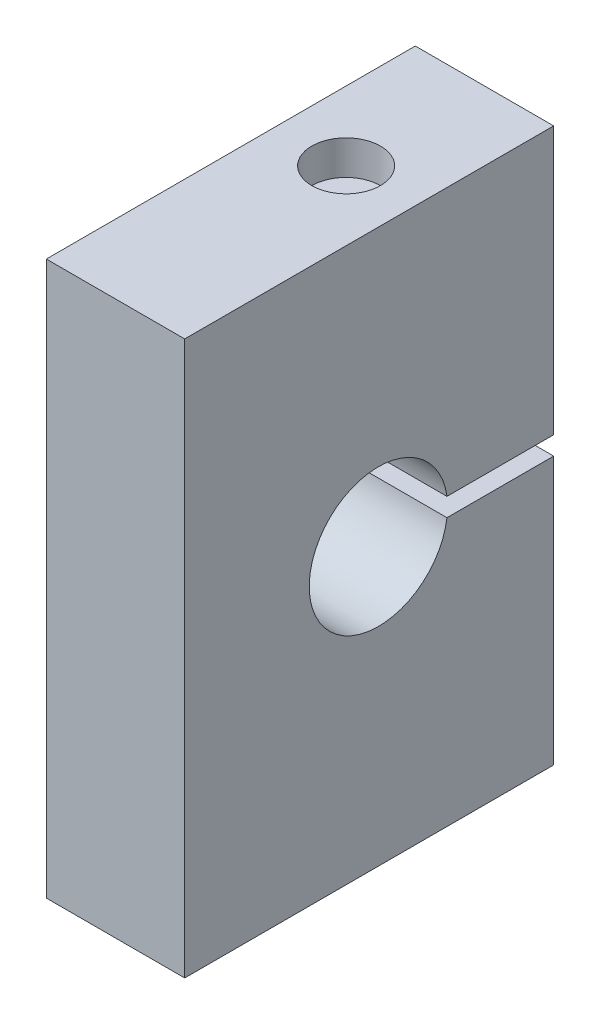
ISO-10303-21;
HEADER;
FILE_DESCRIPTION(('STEP AP214'),'2;1');
FILE_NAME('part.step','',(''),(''),'','','');
FILE_SCHEMA(('AUTOMOTIVE_DESIGN { 1 0 10303 214 1 1 1 1 }'));
ENDSEC;
DATA;
#1=APPLICATION_CONTEXT('core data for automotive mechanical design processes');
#2=APPLICATION_PROTOCOL_DEFINITION('international standard','automotive_design',2000,#1);
#3=PRODUCT_CONTEXT('',#1,'mechanical');
#4=PRODUCT('Part','Part','',(#3));
#5=PRODUCT_RELATED_PRODUCT_CATEGORY('part','',(#4));
#6=PRODUCT_DEFINITION_FORMATION('','',#4);
#7=PRODUCT_DEFINITION_CONTEXT('part definition',#1,'design');
#8=PRODUCT_DEFINITION('design','',#6,#7);
#9=PRODUCT_DEFINITION_SHAPE('','',#8);
#10=(LENGTH_UNIT() NAMED_UNIT(*) SI_UNIT(.MILLI.,.METRE.));
#11=(NAMED_UNIT(*) PLANE_ANGLE_UNIT() SI_UNIT($,.RADIAN.));
#12=(NAMED_UNIT(*) SI_UNIT($,.STERADIAN.) SOLID_ANGLE_UNIT());
#13=UNCERTAINTY_MEASURE_WITH_UNIT(LENGTH_MEASURE(1.E-05),#10,'distance_accuracy_value','');
#14=(GEOMETRIC_REPRESENTATION_CONTEXT(3) GLOBAL_UNCERTAINTY_ASSIGNED_CONTEXT((#13)) GLOBAL_UNIT_ASSIGNED_CONTEXT((#10,
#11,#12)) REPRESENTATION_CONTEXT('',''));
#15=CARTESIAN_POINT('',(0.,0.,0.));
#16=DIRECTION('',(0.,0.,1.));
#17=DIRECTION('',(1.,0.,0.));
#18=AXIS2_PLACEMENT_3D('',#15,#16,#17);
#19=CARTESIAN_POINT('',(19.05,0.,0.));
#20=DIRECTION('',(0.,0.,-1.));
#21=DIRECTION('',(-1.,0.,0.));
#22=AXIS2_PLACEMENT_3D('',#19,#20,#21);
#23=PLANE('',#22);
#24=DIRECTION('',(0.,-1.,0.));
#25=VECTOR('',#24,1.);
#26=CARTESIAN_POINT('',(0.,0.,0.));
#27=LINE('',#26,#25);
#28=CARTESIAN_POINT('',(0.,76.2,0.));
#29=VERTEX_POINT('',#28);
#30=CARTESIAN_POINT('',(0.,0.,0.));
#31=VERTEX_POINT('',#30);
#32=EDGE_CURVE('E138',#29,#31,#27,.T.);
#33=ORIENTED_EDGE('',*,*,#32,.T.);
#34=DIRECTION('',(-1.,0.,0.));
#35=VECTOR('',#34,1.);
#36=CARTESIAN_POINT('',(19.05,0.,0.));
#37=LINE('',#36,#35);
#38=CARTESIAN_POINT('',(19.05,0.,0.));
#39=VERTEX_POINT('',#38);
#40=EDGE_CURVE('E11',#39,#31,#37,.T.);
#41=ORIENTED_EDGE('',*,*,#40,.F.);
#42=DIRECTION('',(0.,-1.,0.));
#43=VECTOR('',#42,1.);
#44=CARTESIAN_POINT('',(19.05,0.,0.));
#45=LINE('',#44,#43);
#46=CARTESIAN_POINT('',(19.05,76.2,0.));
#47=VERTEX_POINT('',#46);
#48=EDGE_CURVE('E153',#47,#39,#45,.T.);
#49=ORIENTED_EDGE('',*,*,#48,.F.);
#50=DIRECTION('',(-1.,0.,0.));
#51=VECTOR('',#50,1.);
#52=CARTESIAN_POINT('',(19.05,76.2,0.));
#53=LINE('',#52,#51);
#54=EDGE_CURVE('E134',#47,#29,#53,.T.);
#55=ORIENTED_EDGE('',*,*,#54,.T.);
#56=EDGE_LOOP('',(#33,#41,#49,#55));
#57=FACE_BOUND('',#56,.T.);
#58=ADVANCED_FACE('F39',(#57),#23,.F.);
#59=CARTESIAN_POINT('',(19.05,0.,0.));
#60=DIRECTION('',(0.,1.,0.));
#61=DIRECTION('',(0.,0.,1.));
#62=AXIS2_PLACEMENT_3D('',#59,#60,#61);
#63=PLANE('',#62);
#64=CARTESIAN_POINT('',(9.525,0.,-12.7));
#65=DIRECTION('',(0.,-1.,0.));
#66=DIRECTION('',(0.,0.,-1.));
#67=AXIS2_PLACEMENT_3D('',#64,#65,#66);
#68=CIRCLE('',#67,3.1877);
#69=CARTESIAN_POINT('',(9.525,0.,-15.8877));
#70=VERTEX_POINT('',#69);
#71=EDGE_CURVE('E200',#70,#70,#68,.T.);
#72=ORIENTED_EDGE('',*,*,#71,.F.);
#73=EDGE_LOOP('',(#72));
#74=FACE_BOUND('',#73,.T.);
#75=CARTESIAN_POINT('',(9.525,0.,-38.1));
#76=DIRECTION('',(0.,-1.,0.));
#77=DIRECTION('',(0.,0.,-1.));
#78=AXIS2_PLACEMENT_3D('',#75,#76,#77);
#79=CIRCLE('',#78,3.1877);
#80=CARTESIAN_POINT('',(9.525,0.,-41.2877));
#81=VERTEX_POINT('',#80);
#82=EDGE_CURVE('E191',#81,#81,#79,.T.);
#83=ORIENTED_EDGE('',*,*,#82,.F.);
#84=EDGE_LOOP('',(#83));
#85=FACE_BOUND('',#84,.T.);
#86=DIRECTION('',(0.,0.,-1.));
#87=VECTOR('',#86,1.);
#88=CARTESIAN_POINT('',(0.,0.,0.));
#89=LINE('',#88,#87);
#90=CARTESIAN_POINT('',(0.,0.,-50.8));
#91=VERTEX_POINT('',#90);
#92=EDGE_CURVE('E141',#31,#91,#89,.T.);
#93=ORIENTED_EDGE('',*,*,#92,.T.);
#94=DIRECTION('',(-1.,0.,0.));
#95=VECTOR('',#94,1.);
#96=CARTESIAN_POINT('',(19.05,0.,-50.8));
#97=LINE('',#96,#95);
#98=CARTESIAN_POINT('',(19.05,0.,-50.8));
#99=VERTEX_POINT('',#98);
#100=EDGE_CURVE('E47',#99,#91,#97,.T.);
#101=ORIENTED_EDGE('',*,*,#100,.F.);
#102=DIRECTION('',(0.,0.,-1.));
#103=VECTOR('',#102,1.);
#104=CARTESIAN_POINT('',(19.05,0.,0.));
#105=LINE('',#104,#103);
#106=EDGE_CURVE('E99',#39,#99,#105,.T.);
#107=ORIENTED_EDGE('',*,*,#106,.F.);
#108=ORIENTED_EDGE('',*,*,#40,.T.);
#109=EDGE_LOOP('',(#93,#101,#107,#108));
#110=FACE_BOUND('',#109,.T.);
#111=ADVANCED_FACE('F230',(#74,#85,#110),#63,.F.);
#112=CARTESIAN_POINT('',(19.05,0.,-50.8));
#113=DIRECTION('',(0.,0.,1.));
#114=DIRECTION('',(1.,0.,0.));
#115=AXIS2_PLACEMENT_3D('',#112,#113,#114);
#116=PLANE('',#115);
#117=DIRECTION('',(0.,1.,0.));
#118=VECTOR('',#117,1.);
#119=CARTESIAN_POINT('',(0.,0.,-50.8));
#120=LINE('',#119,#118);
#121=CARTESIAN_POINT('',(0.,36.83,-50.8));
#122=VERTEX_POINT('',#121);
#123=EDGE_CURVE('E144',#91,#122,#120,.T.);
#124=ORIENTED_EDGE('',*,*,#123,.T.);
#125=DIRECTION('',(-1.,0.,0.));
#126=VECTOR('',#125,1.);
#127=CARTESIAN_POINT('',(19.05,36.83,-50.8));
#128=LINE('',#127,#126);
#129=CARTESIAN_POINT('',(19.05,36.83,-50.8));
#130=VERTEX_POINT('',#129);
#131=EDGE_CURVE('E160',#130,#122,#128,.T.);
#132=ORIENTED_EDGE('',*,*,#131,.F.);
#133=DIRECTION('',(0.,1.,0.));
#134=VECTOR('',#133,1.);
#135=CARTESIAN_POINT('',(19.05,0.,-50.8));
#136=LINE('',#135,#134);
#137=EDGE_CURVE('E168',#99,#130,#136,.T.);
#138=ORIENTED_EDGE('',*,*,#137,.F.);
#139=ORIENTED_EDGE('',*,*,#100,.T.);
#140=EDGE_LOOP('',(#124,#132,#138,#139));
#141=FACE_BOUND('',#140,.T.);
#142=ADVANCED_FACE('F166',(#141),#116,.F.);
#143=CARTESIAN_POINT('',(19.05,36.83,-36.1099536545472));
#144=DIRECTION('',(0.,-1.,0.));
#145=DIRECTION('',(0.,0.,-1.));
#146=AXIS2_PLACEMENT_3D('',#143,#144,#145);
#147=PLANE('',#146);
#148=DIRECTION('',(0.,0.,1.));
#149=VECTOR('',#148,1.);
#150=CARTESIAN_POINT('',(0.,36.83,-36.1099536545472));
#151=LINE('',#150,#149);
#152=CARTESIAN_POINT('',(0.,36.83,-36.1099536545472));
#153=VERTEX_POINT('',#152);
#154=EDGE_CURVE('E146',#122,#153,#151,.T.);
#155=ORIENTED_EDGE('',*,*,#154,.T.);
#156=DIRECTION('',(-1.,0.,0.));
#157=VECTOR('',#156,1.);
#158=CARTESIAN_POINT('',(19.05,36.83,-36.1099536545472));
#159=LINE('',#158,#157);
#160=CARTESIAN_POINT('',(19.05,36.83,-36.1099536545472));
#161=VERTEX_POINT('',#160);
#162=EDGE_CURVE('E157',#161,#153,#159,.T.);
#163=ORIENTED_EDGE('',*,*,#162,.F.);
#164=DIRECTION('',(0.,0.,1.));
#165=VECTOR('',#164,1.);
#166=CARTESIAN_POINT('',(19.05,36.83,-36.1099536545472));
#167=LINE('',#166,#165);
#168=EDGE_CURVE('E180',#130,#161,#167,.T.);
#169=ORIENTED_EDGE('',*,*,#168,.F.);
#170=ORIENTED_EDGE('',*,*,#131,.T.);
#171=EDGE_LOOP('',(#155,#163,#169,#170));
#172=FACE_BOUND('',#171,.T.);
#173=ADVANCED_FACE('F176',(#172),#147,.F.);
#174=CARTESIAN_POINT('',(19.05,38.1,-26.67));
#175=DIRECTION('',(-1.,0.,0.));
#176=DIRECTION('',(0.,0.,1.));
#177=AXIS2_PLACEMENT_3D('',#174,#175,#176);
#178=CYLINDRICAL_SURFACE('',#177,9.525);
#179=CARTESIAN_POINT('',(0.,38.1,-26.67));
#180=DIRECTION('',(-1.,0.,0.));
#181=DIRECTION('',(0.,0.,-1.));
#182=AXIS2_PLACEMENT_3D('',#179,#180,#181);
#183=CIRCLE('',#182,9.525);
#184=CARTESIAN_POINT('',(0.,39.37,-36.1099536545472));
#185=VERTEX_POINT('',#184);
#186=EDGE_CURVE('E148',#153,#185,#183,.T.);
#187=ORIENTED_EDGE('',*,*,#186,.T.);
#188=DIRECTION('',(-1.,0.,0.));
#189=VECTOR('',#188,1.);
#190=CARTESIAN_POINT('',(19.05,39.37,-36.1099536545472));
#191=LINE('',#190,#189);
#192=CARTESIAN_POINT('',(19.05,39.37,-36.1099536545472));
#193=VERTEX_POINT('',#192);
#194=EDGE_CURVE('E129',#193,#185,#191,.T.);
#195=ORIENTED_EDGE('',*,*,#194,.F.);
#196=CARTESIAN_POINT('',(19.05,38.1,-26.67));
#197=DIRECTION('',(-1.,0.,0.));
#198=DIRECTION('',(0.,0.,-1.));
#199=AXIS2_PLACEMENT_3D('',#196,#197,#198);
#200=CIRCLE('',#199,9.525);
#201=EDGE_CURVE('E120',#161,#193,#200,.T.);
#202=ORIENTED_EDGE('',*,*,#201,.F.);
#203=ORIENTED_EDGE('',*,*,#162,.T.);
#204=EDGE_LOOP('',(#187,#195,#202,#203));
#205=FACE_BOUND('',#204,.T.);
#206=ADVANCED_FACE('F179',(#205),#178,.F.);
#207=CARTESIAN_POINT('',(19.05,39.37,-36.1099536545472));
#208=DIRECTION('',(0.,1.,0.));
#209=DIRECTION('',(0.,0.,1.));
#210=AXIS2_PLACEMENT_3D('',#207,#208,#209);
#211=PLANE('',#210);
#212=DIRECTION('',(0.,0.,-1.));
#213=VECTOR('',#212,1.);
#214=CARTESIAN_POINT('',(0.,39.37,-36.1099536545472));
#215=LINE('',#214,#213);
#216=CARTESIAN_POINT('',(0.,39.37,-50.8));
#217=VERTEX_POINT('',#216);
#218=EDGE_CURVE('E128',#185,#217,#215,.T.);
#219=ORIENTED_EDGE('',*,*,#218,.T.);
#220=DIRECTION('',(-1.,0.,0.));
#221=VECTOR('',#220,1.);
#222=CARTESIAN_POINT('',(19.05,39.37,-50.8));
#223=LINE('',#222,#221);
#224=CARTESIAN_POINT('',(19.05,39.37,-50.8));
#225=VERTEX_POINT('',#224);
#226=EDGE_CURVE('E125',#225,#217,#223,.T.);
#227=ORIENTED_EDGE('',*,*,#226,.F.);
#228=DIRECTION('',(0.,0.,-1.));
#229=VECTOR('',#228,1.);
#230=CARTESIAN_POINT('',(19.05,39.37,-36.1099536545472));
#231=LINE('',#230,#229);
#232=EDGE_CURVE('E114',#193,#225,#231,.T.);
#233=ORIENTED_EDGE('',*,*,#232,.F.);
#234=ORIENTED_EDGE('',*,*,#194,.T.);
#235=EDGE_LOOP('',(#219,#227,#233,#234));
#236=FACE_BOUND('',#235,.T.);
#237=ADVANCED_FACE('F126',(#236),#211,.F.);
#238=CARTESIAN_POINT('',(19.05,39.37,-50.8));
#239=DIRECTION('',(0.,0.,1.));
#240=DIRECTION('',(1.,0.,0.));
#241=AXIS2_PLACEMENT_3D('',#238,#239,#240);
#242=PLANE('',#241);
#243=DIRECTION('',(0.,1.,0.));
#244=VECTOR('',#243,1.);
#245=CARTESIAN_POINT('',(0.,39.37,-50.8));
#246=LINE('',#245,#244);
#247=CARTESIAN_POINT('',(0.,76.2,-50.8));
#248=VERTEX_POINT('',#247);
#249=EDGE_CURVE('E85',#217,#248,#246,.T.);
#250=ORIENTED_EDGE('',*,*,#249,.T.);
#251=DIRECTION('',(-1.,0.,0.));
#252=VECTOR('',#251,1.);
#253=CARTESIAN_POINT('',(19.05,76.2,-50.8));
#254=LINE('',#253,#252);
#255=CARTESIAN_POINT('',(19.05,76.2,-50.8));
#256=VERTEX_POINT('',#255);
#257=EDGE_CURVE('E130',#256,#248,#254,.T.);
#258=ORIENTED_EDGE('',*,*,#257,.F.);
#259=DIRECTION('',(0.,1.,0.));
#260=VECTOR('',#259,1.);
#261=CARTESIAN_POINT('',(19.05,39.37,-50.8));
#262=LINE('',#261,#260);
#263=EDGE_CURVE('E118',#225,#256,#262,.T.);
#264=ORIENTED_EDGE('',*,*,#263,.F.);
#265=ORIENTED_EDGE('',*,*,#226,.T.);
#266=EDGE_LOOP('',(#250,#258,#264,#265));
#267=FACE_BOUND('',#266,.T.);
#268=ADVANCED_FACE('F132',(#267),#242,.F.);
#269=CARTESIAN_POINT('',(19.05,76.2,0.));
#270=DIRECTION('',(0.,-1.,0.));
#271=DIRECTION('',(0.,0.,-1.));
#272=AXIS2_PLACEMENT_3D('',#269,#270,#271);
#273=PLANE('',#272);
#274=CARTESIAN_POINT('',(9.525,76.2,-31.75));
#275=DIRECTION('',(0.,1.,0.));
#276=DIRECTION('',(0.,0.,1.));
#277=AXIS2_PLACEMENT_3D('',#274,#275,#276);
#278=CIRCLE('',#277,4.7244);
#279=CARTESIAN_POINT('',(9.525,76.2,-27.0256));
#280=VERTEX_POINT('',#279);
#281=EDGE_CURVE('E204',#280,#280,#278,.T.);
#282=ORIENTED_EDGE('',*,*,#281,.F.);
#283=EDGE_LOOP('',(#282));
#284=FACE_BOUND('',#283,.T.);
#285=DIRECTION('',(0.,0.,1.));
#286=VECTOR('',#285,1.);
#287=CARTESIAN_POINT('',(0.,76.2,0.));
#288=LINE('',#287,#286);
#289=EDGE_CURVE('E91',#248,#29,#288,.T.);
#290=ORIENTED_EDGE('',*,*,#289,.T.);
#291=ORIENTED_EDGE('',*,*,#54,.F.);
#292=DIRECTION('',(0.,0.,1.));
#293=VECTOR('',#292,1.);
#294=CARTESIAN_POINT('',(19.05,76.2,0.));
#295=LINE('',#294,#293);
#296=EDGE_CURVE('E55',#256,#47,#295,.T.);
#297=ORIENTED_EDGE('',*,*,#296,.F.);
#298=ORIENTED_EDGE('',*,*,#257,.T.);
#299=EDGE_LOOP('',(#290,#291,#297,#298));
#300=FACE_BOUND('',#299,.T.);
#301=ADVANCED_FACE('F219',(#284,#300),#273,.F.);
#302=CARTESIAN_POINT('',(19.05,38.1,-26.67));
#303=DIRECTION('',(1.,0.,0.));
#304=DIRECTION('',(0.,0.,-1.));
#305=AXIS2_PLACEMENT_3D('',#302,#303,#304);
#306=PLANE('',#305);
#307=ORIENTED_EDGE('',*,*,#48,.T.);
#308=ORIENTED_EDGE('',*,*,#106,.T.);
#309=ORIENTED_EDGE('',*,*,#137,.T.);
#310=ORIENTED_EDGE('',*,*,#168,.T.);
#311=ORIENTED_EDGE('',*,*,#201,.T.);
#312=ORIENTED_EDGE('',*,*,#232,.T.);
#313=ORIENTED_EDGE('',*,*,#263,.T.);
#314=ORIENTED_EDGE('',*,*,#296,.T.);
#315=EDGE_LOOP('',(#307,#308,#309,#310,#311,#312,#313,#314));
#316=FACE_BOUND('',#315,.T.);
#317=ADVANCED_FACE('F116',(#316),#306,.T.);
#318=CARTESIAN_POINT('',(0.,38.1,-26.67));
#319=DIRECTION('',(1.,0.,0.));
#320=DIRECTION('',(0.,0.,-1.));
#321=AXIS2_PLACEMENT_3D('',#318,#319,#320);
#322=PLANE('',#321);
#323=ORIENTED_EDGE('',*,*,#32,.F.);
#324=ORIENTED_EDGE('',*,*,#289,.F.);
#325=ORIENTED_EDGE('',*,*,#249,.F.);
#326=ORIENTED_EDGE('',*,*,#218,.F.);
#327=ORIENTED_EDGE('',*,*,#186,.F.);
#328=ORIENTED_EDGE('',*,*,#154,.F.);
#329=ORIENTED_EDGE('',*,*,#123,.F.);
#330=ORIENTED_EDGE('',*,*,#92,.F.);
#331=EDGE_LOOP('',(#323,#324,#325,#326,#327,#328,#329,#330));
#332=FACE_BOUND('',#331,.T.);
#333=ADVANCED_FACE('F172',(#332),#322,.F.);
#334=CARTESIAN_POINT('',(9.525,16.51,-38.1));
#335=DIRECTION('',(0.,-1.,0.));
#336=DIRECTION('',(0.,0.,-1.));
#337=AXIS2_PLACEMENT_3D('',#334,#335,#336);
#338=CONICAL_SURFACE('',#337,2.55269999999999,1.02974425867665);
#339=CARTESIAN_POINT('',(9.525,18.0438169021916,-38.1));
#340=VERTEX_POINT('',#339);
#341=VERTEX_LOOP('',#340);
#342=FACE_BOUND('',#341,.T.);
#343=CARTESIAN_POINT('',(9.525,16.51,-38.1));
#344=DIRECTION('',(0.,-1.,0.));
#345=DIRECTION('',(0.,0.,-1.));
#346=AXIS2_PLACEMENT_3D('',#343,#344,#345);
#347=CIRCLE('',#346,2.55269999999999);
#348=CARTESIAN_POINT('',(9.525,16.51,-40.6527));
#349=VERTEX_POINT('',#348);
#350=EDGE_CURVE('E142',#349,#349,#347,.T.);
#351=ORIENTED_EDGE('',*,*,#350,.T.);
#352=EDGE_LOOP('',(#351));
#353=FACE_BOUND('',#352,.T.);
#354=ADVANCED_FACE('F273',(#342,#353),#338,.F.);
#355=CARTESIAN_POINT('',(9.525,0.,-38.1));
#356=DIRECTION('',(0.,-1.,0.));
#357=DIRECTION('',(0.,0.,-1.));
#358=AXIS2_PLACEMENT_3D('',#355,#356,#357);
#359=CYLINDRICAL_SURFACE('',#358,2.55269999999999);
#360=ORIENTED_EDGE('',*,*,#350,.F.);
#361=EDGE_LOOP('',(#360));
#362=FACE_BOUND('',#361,.T.);
#363=CARTESIAN_POINT('',(9.525,0.635000000000004,-38.1));
#364=DIRECTION('',(0.,-1.,0.));
#365=DIRECTION('',(0.,0.,-1.));
#366=AXIS2_PLACEMENT_3D('',#363,#364,#365);
#367=CIRCLE('',#366,2.5527);
#368=CARTESIAN_POINT('',(9.525,0.635000000000004,-40.6527));
#369=VERTEX_POINT('',#368);
#370=EDGE_CURVE('E188',#369,#369,#367,.T.);
#371=ORIENTED_EDGE('',*,*,#370,.T.);
#372=EDGE_LOOP('',(#371));
#373=FACE_BOUND('',#372,.T.);
#374=ADVANCED_FACE('F288',(#362,#373),#359,.F.);
#375=CARTESIAN_POINT('',(9.525,0.,-38.1));
#376=DIRECTION('',(0.,-1.,0.));
#377=DIRECTION('',(0.,0.,-1.));
#378=AXIS2_PLACEMENT_3D('',#375,#376,#377);
#379=CONICAL_SURFACE('',#378,3.1877,0.785398163397446);
#380=ORIENTED_EDGE('',*,*,#370,.F.);
#381=EDGE_LOOP('',(#380));
#382=FACE_BOUND('',#381,.T.);
#383=ORIENTED_EDGE('',*,*,#82,.T.);
#384=EDGE_LOOP('',(#383));
#385=FACE_BOUND('',#384,.T.);
#386=ADVANCED_FACE('F299',(#382,#385),#379,.F.);
#387=CARTESIAN_POINT('',(9.525,16.51,-12.7));
#388=DIRECTION('',(0.,-1.,0.));
#389=DIRECTION('',(0.,0.,-1.));
#390=AXIS2_PLACEMENT_3D('',#387,#388,#389);
#391=CONICAL_SURFACE('',#390,2.55269999999999,1.02974425867665);
#392=CARTESIAN_POINT('',(9.525,18.0438169021916,-12.7));
#393=VERTEX_POINT('',#392);
#394=VERTEX_LOOP('',#393);
#395=FACE_BOUND('',#394,.T.);
#396=CARTESIAN_POINT('',(9.525,16.51,-12.7));
#397=DIRECTION('',(0.,-1.,0.));
#398=DIRECTION('',(0.,0.,-1.));
#399=AXIS2_PLACEMENT_3D('',#396,#397,#398);
#400=CIRCLE('',#399,2.55269999999999);
#401=CARTESIAN_POINT('',(9.525,16.51,-15.2527));
#402=VERTEX_POINT('',#401);
#403=EDGE_CURVE('E194',#402,#402,#400,.T.);
#404=ORIENTED_EDGE('',*,*,#403,.T.);
#405=EDGE_LOOP('',(#404));
#406=FACE_BOUND('',#405,.T.);
#407=ADVANCED_FACE('F311',(#395,#406),#391,.F.);
#408=CARTESIAN_POINT('',(9.525,0.,-12.7));
#409=DIRECTION('',(0.,-1.,0.));
#410=DIRECTION('',(0.,0.,-1.));
#411=AXIS2_PLACEMENT_3D('',#408,#409,#410);
#412=CYLINDRICAL_SURFACE('',#411,2.55269999999999);
#413=ORIENTED_EDGE('',*,*,#403,.F.);
#414=EDGE_LOOP('',(#413));
#415=FACE_BOUND('',#414,.T.);
#416=CARTESIAN_POINT('',(9.525,0.635000000000004,-12.7));
#417=DIRECTION('',(0.,-1.,0.));
#418=DIRECTION('',(0.,0.,-1.));
#419=AXIS2_PLACEMENT_3D('',#416,#417,#418);
#420=CIRCLE('',#419,2.5527);
#421=CARTESIAN_POINT('',(9.525,0.635000000000004,-15.2527));
#422=VERTEX_POINT('',#421);
#423=EDGE_CURVE('E197',#422,#422,#420,.T.);
#424=ORIENTED_EDGE('',*,*,#423,.T.);
#425=EDGE_LOOP('',(#424));
#426=FACE_BOUND('',#425,.T.);
#427=ADVANCED_FACE('F321',(#415,#426),#412,.F.);
#428=CARTESIAN_POINT('',(9.525,0.,-12.7));
#429=DIRECTION('',(0.,-1.,0.));
#430=DIRECTION('',(0.,0.,-1.));
#431=AXIS2_PLACEMENT_3D('',#428,#429,#430);
#432=CONICAL_SURFACE('',#431,3.1877,0.785398163397446);
#433=ORIENTED_EDGE('',*,*,#423,.F.);
#434=EDGE_LOOP('',(#433));
#435=FACE_BOUND('',#434,.T.);
#436=ORIENTED_EDGE('',*,*,#71,.T.);
#437=EDGE_LOOP('',(#436));
#438=FACE_BOUND('',#437,.T.);
#439=ADVANCED_FACE('F215',(#435,#438),#432,.F.);
#440=CARTESIAN_POINT('',(9.525,71.4756,-31.75));
#441=DIRECTION('',(0.,1.,0.));
#442=DIRECTION('',(0.,0.,1.));
#443=AXIS2_PLACEMENT_3D('',#440,#441,#442);
#444=CYLINDRICAL_SURFACE('',#443,4.7244);
#445=CARTESIAN_POINT('',(9.525,71.4756,-31.75));
#446=DIRECTION('',(0.,1.,0.));
#447=DIRECTION('',(0.,0.,1.));
#448=AXIS2_PLACEMENT_3D('',#445,#446,#447);
#449=CIRCLE('',#448,4.7244);
#450=CARTESIAN_POINT('',(9.525,71.4756,-27.0256));
#451=VERTEX_POINT('',#450);
#452=EDGE_CURVE('E203',#451,#451,#449,.T.);
#453=ORIENTED_EDGE('',*,*,#452,.F.);
#454=EDGE_LOOP('',(#453));
#455=FACE_BOUND('',#454,.T.);
#456=ORIENTED_EDGE('',*,*,#281,.T.);
#457=EDGE_LOOP('',(#456));
#458=FACE_BOUND('',#457,.T.);
#459=ADVANCED_FACE('F212',(#455,#458),#444,.F.);
#460=CARTESIAN_POINT('',(9.525,71.4756,-31.75));
#461=DIRECTION('',(0.,1.,0.));
#462=DIRECTION('',(0.,0.,1.));
#463=AXIS2_PLACEMENT_3D('',#460,#461,#462);
#464=PLANE('',#463);
#465=ORIENTED_EDGE('',*,*,#452,.T.);
#466=EDGE_LOOP('',(#465));
#467=FACE_BOUND('',#466,.T.);
#468=ADVANCED_FACE('F210',(#467),#464,.T.);
#469=CLOSED_SHELL('',(#58,#111,#142,#173,#206,#237,#268,#301,#317,#333,#354,#374,#386,#407,#427,
#439,#459,#468));
#470=MANIFOLD_SOLID_BREP('B2',#469);
#471=ADVANCED_BREP_SHAPE_REPRESENTATION('',(#18,#470),#14);
#472=SHAPE_DEFINITION_REPRESENTATION(#9,#471);
ENDSEC;
END-ISO-10303-21;
